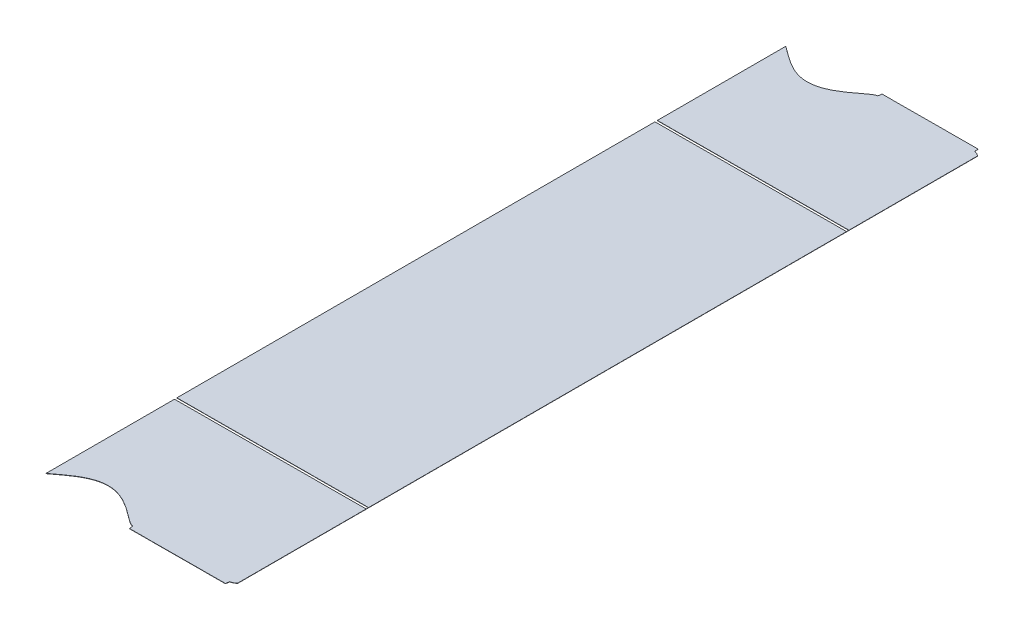
ISO-10303-21;
HEADER;
FILE_DESCRIPTION(('STEP AP214'),'2;1');
FILE_NAME('part.step','',(''),(''),'','','');
FILE_SCHEMA(('AUTOMOTIVE_DESIGN { 1 0 10303 214 1 1 1 1 }'));
ENDSEC;
DATA;
#1=APPLICATION_CONTEXT('core data for automotive mechanical design processes');
#2=APPLICATION_PROTOCOL_DEFINITION('international standard','automotive_design',2000,#1);
#3=PRODUCT_CONTEXT('',#1,'mechanical');
#4=PRODUCT('Part','Part','',(#3));
#5=PRODUCT_RELATED_PRODUCT_CATEGORY('part','',(#4));
#6=PRODUCT_DEFINITION_FORMATION('','',#4);
#7=PRODUCT_DEFINITION_CONTEXT('part definition',#1,'design');
#8=PRODUCT_DEFINITION('design','',#6,#7);
#9=PRODUCT_DEFINITION_SHAPE('','',#8);
#10=(LENGTH_UNIT() NAMED_UNIT(*) SI_UNIT(.MILLI.,.METRE.));
#11=(NAMED_UNIT(*) PLANE_ANGLE_UNIT() SI_UNIT($,.RADIAN.));
#12=(NAMED_UNIT(*) SI_UNIT($,.STERADIAN.) SOLID_ANGLE_UNIT());
#13=UNCERTAINTY_MEASURE_WITH_UNIT(LENGTH_MEASURE(1.E-05),#10,'distance_accuracy_value','');
#14=(GEOMETRIC_REPRESENTATION_CONTEXT(3) GLOBAL_UNCERTAINTY_ASSIGNED_CONTEXT((#13)) GLOBAL_UNIT_ASSIGNED_CONTEXT((#10,
#11,#12)) REPRESENTATION_CONTEXT('',''));
#15=CARTESIAN_POINT('',(0.,0.,0.));
#16=DIRECTION('',(0.,0.,1.));
#17=DIRECTION('',(1.,0.,0.));
#18=AXIS2_PLACEMENT_3D('',#15,#16,#17);
#19=CARTESIAN_POINT('',(-479.431668854931,493.816892477941,-153.223013684118));
#20=DIRECTION('',(0.999992126449225,0.00396825396825353,0.));
#21=DIRECTION('',(-0.00396825396825353,0.999992126449225,0.));
#22=AXIS2_PLACEMENT_3D('',#19,#20,#21);
#23=PLANE('',#22);
#24=DIRECTION('',(-0.00396825396825353,0.999992126449225,0.));
#25=VECTOR('',#24,1.);
#26=CARTESIAN_POINT('',(-479.431668854931,493.816892477941,100.));
#27=LINE('',#26,#25);
#28=CARTESIAN_POINT('',(-479.431272029534,493.716893265296,100.));
#29=VERTEX_POINT('',#28);
#30=CARTESIAN_POINT('',(-479.431668854931,493.816892477941,100.));
#31=VERTEX_POINT('',#30);
#32=EDGE_CURVE('E220',#29,#31,#27,.T.);
#33=ORIENTED_EDGE('',*,*,#32,.F.);
#34=DIRECTION('',(0.,0.,1.));
#35=VECTOR('',#34,1.);
#36=CARTESIAN_POINT('',(-479.431272029534,493.716893265296,-153.223013684118));
#37=LINE('',#36,#35);
#38=CARTESIAN_POINT('',(-479.431272029534,493.716893265296,153.223013684118));
#39=VERTEX_POINT('',#38);
#40=EDGE_CURVE('E269',#29,#39,#37,.T.);
#41=ORIENTED_EDGE('',*,*,#40,.T.);
#42=DIRECTION('',(0.00396825396825353,-0.999992126449225,0.));
#43=VECTOR('',#42,1.);
#44=CARTESIAN_POINT('',(-479.431668854931,493.816892477941,153.223013684118));
#45=LINE('',#44,#43);
#46=CARTESIAN_POINT('',(-479.431668854931,493.816892477941,153.223013684118));
#47=VERTEX_POINT('',#46);
#48=EDGE_CURVE('E327',#47,#39,#45,.T.);
#49=ORIENTED_EDGE('',*,*,#48,.F.);
#50=DIRECTION('',(0.,0.,1.));
#51=VECTOR('',#50,1.);
#52=CARTESIAN_POINT('',(-479.431668854931,493.816892477941,-153.223013684118));
#53=LINE('',#52,#51);
#54=EDGE_CURVE('E389',#31,#47,#53,.T.);
#55=ORIENTED_EDGE('',*,*,#54,.F.);
#56=EDGE_LOOP('',(#33,#41,#49,#55));
#57=FACE_BOUND('',#56,.T.);
#58=ADVANCED_FACE('F60',(#57),#23,.F.);
#59=DIRECTION('',(0.00396825396825353,-0.999992126449225,0.));
#60=VECTOR('',#59,1.);
#61=CARTESIAN_POINT('',(-479.431668854931,493.816892477941,98.9999999999999));
#62=LINE('',#61,#60);
#63=CARTESIAN_POINT('',(-479.431668854931,493.816892477941,98.9999999999999));
#64=VERTEX_POINT('',#63);
#65=CARTESIAN_POINT('',(-479.431272029534,493.716893265296,98.9999999999998));
#66=VERTEX_POINT('',#65);
#67=EDGE_CURVE('E221',#64,#66,#62,.T.);
#68=ORIENTED_EDGE('',*,*,#67,.F.);
#69=CARTESIAN_POINT('',(-479.431668854931,493.816892477941,-99.0000000000001));
#70=VERTEX_POINT('',#69);
#71=EDGE_CURVE('E219',#70,#64,#53,.T.);
#72=ORIENTED_EDGE('',*,*,#71,.F.);
#73=DIRECTION('',(-0.00396825396825353,0.999992126449225,0.));
#74=VECTOR('',#73,1.);
#75=CARTESIAN_POINT('',(-479.431668854931,493.816892477941,-99.));
#76=LINE('',#75,#74);
#77=CARTESIAN_POINT('',(-479.431272029534,493.716893265296,-99.0000000000002));
#78=VERTEX_POINT('',#77);
#79=EDGE_CURVE('E353',#78,#70,#76,.T.);
#80=ORIENTED_EDGE('',*,*,#79,.F.);
#81=EDGE_CURVE('E277',#78,#66,#37,.T.);
#82=ORIENTED_EDGE('',*,*,#81,.T.);
#83=EDGE_LOOP('',(#68,#72,#80,#82));
#84=FACE_BOUND('',#83,.T.);
#85=ADVANCED_FACE('F361',(#84),#23,.F.);
#86=CARTESIAN_POINT('',(2716.99564082049,506.501227704552,3272.92410906233));
#87=DIRECTION('',(-0.00396825396825352,0.999992126449225,0.));
#88=DIRECTION('',(-0.999992126449225,-0.00396825396825352,0.));
#89=AXIS2_PLACEMENT_3D('',#86,#87,#88);
#90=PLANE('',#89);
#91=DIRECTION('',(0.,0.,1.));
#92=VECTOR('',#91,1.);
#93=CARTESIAN_POINT('',(-400.050396825397,494.131900005905,-153.292164397325));
#94=LINE('',#93,#92);
#95=CARTESIAN_POINT('',(-400.050396825397,494.131900005905,99.9999999999999));
#96=VERTEX_POINT('',#95);
#97=CARTESIAN_POINT('',(-400.050396825397,494.131900005905,153.292164397326));
#98=VERTEX_POINT('',#97);
#99=EDGE_CURVE('E228',#96,#98,#94,.T.);
#100=ORIENTED_EDGE('',*,*,#99,.F.);
#101=DIRECTION('',(-0.999992126449225,-0.00396825396825352,0.));
#102=VECTOR('',#101,1.);
#103=CARTESIAN_POINT('',(2716.99564082049,506.501227704552,100.));
#104=LINE('',#103,#102);
#105=EDGE_CURVE('E461',#96,#31,#104,.T.);
#106=ORIENTED_EDGE('',*,*,#105,.T.);
#107=ORIENTED_EDGE('',*,*,#54,.T.);
#108=CARTESIAN_POINT('',(-442.431061801277,493.963721439775,154.262931630912));
#109=CARTESIAN_POINT('',(-442.591631623107,493.963084252925,154.262974500133));
#110=CARTESIAN_POINT('',(-442.912981243013,493.96180904598,154.202254506324));
#111=CARTESIAN_POINT('',(-443.351084597071,493.960070526919,154.053043762409));
#112=CARTESIAN_POINT('',(-443.934449320149,493.957755569315,153.739597349899));
#113=CARTESIAN_POINT('',(-444.489085882647,493.955554613245,153.383793422581));
#114=CARTESIAN_POINT('',(-444.786625588,493.954373890832,153.175910568641));
#115=CARTESIAN_POINT('',(-445.208979985696,493.952697868121,152.880823103045));
#116=CARTESIAN_POINT('',(-445.846071955568,493.950169705478,152.404899446286));
#117=CARTESIAN_POINT('',(-446.061276671207,493.949315711787,152.244136134138));
#118=CARTESIAN_POINT('',(-446.625932400914,493.947074996805,151.8182250494));
#119=CARTESIAN_POINT('',(-447.46885109117,493.943730055031,151.180945823583));
#120=CARTESIAN_POINT('',(-447.922424993525,493.941930144421,150.843545013171));
#121=CARTESIAN_POINT('',(-448.483580695191,493.939703318548,150.426117141931));
#122=CARTESIAN_POINT('',(-448.970134964303,493.937772532437,150.075627268659));
#123=CARTESIAN_POINT('',(-450.121645096203,493.933203011808,149.246135748754));
#124=CARTESIAN_POINT('',(-451.129980630493,493.929201648818,148.594589446881));
#125=CARTESIAN_POINT('',(-452.289992781982,493.924598389751,147.845035749992));
#126=CARTESIAN_POINT('',(-453.367727223459,493.920321632103,147.259873451391));
#127=CARTESIAN_POINT('',(-454.578789572927,493.91551579129,146.602319975423));
#128=CARTESIAN_POINT('',(-455.732811540838,493.91093630298,146.126381248756));
#129=CARTESIAN_POINT('',(-456.992552417681,493.905937291886,145.606842205717));
#130=CARTESIAN_POINT('',(-459.507782600744,493.895956141144,144.956863987269));
#131=CARTESIAN_POINT('',(-462.093411956329,493.885695626407,144.729647743447));
#132=CARTESIAN_POINT('',(-464.68729863891,493.875402344241,144.963887418469));
#133=CARTESIAN_POINT('',(-467.212399896033,493.865382022261,145.625036313167));
#134=CARTESIAN_POINT('',(-468.473936649228,493.860375884618,146.149467436179));
#135=CARTESIAN_POINT('',(-469.622449980007,493.855818256151,146.62691380017));
#136=CARTESIAN_POINT('',(-470.828214311532,493.851033439384,147.284375163813));
#137=CARTESIAN_POINT('',(-471.910430832478,493.846738895567,147.8744702023));
#138=CARTESIAN_POINT('',(-473.076869107019,493.842110135811,148.630865638333));
#139=CARTESIAN_POINT('',(-474.077490900206,493.838139383145,149.279734741894));
#140=CARTESIAN_POINT('',(-475.222134181215,493.833597112139,150.105598241184));
#141=CARTESIAN_POINT('',(-475.708137335926,493.831668513007,150.456250949039));
#142=CARTESIAN_POINT('',(-476.271534551234,493.829432792169,150.875783704997));
#143=CARTESIAN_POINT('',(-476.671169570571,493.827846926431,151.173371226703));
#144=CARTESIAN_POINT('',(-477.318873737737,493.825276651562,151.662594456796));
#145=CARTESIAN_POINT('',(-477.748556584883,493.823571547474,151.987142052832));
#146=CARTESIAN_POINT('',(-477.843166287971,493.823196109188,152.058462379137));
#147=CARTESIAN_POINT('',(-478.148022723046,493.821986351905,152.288274541273));
#148=CARTESIAN_POINT('',(-478.368072586016,493.821113131287,152.452339942692));
#149=CARTESIAN_POINT('',(-479.005890197137,493.818582089093,152.927885807564));
#150=CARTESIAN_POINT('',(-479.431668854931,493.816892477941,153.223013684118));
#151=B_SPLINE_CURVE_WITH_KNOTS('',2,(#108,#109,#110,#111,#112,#113,#114,#115,#116,#117,#118,
#119,#120,#121,#122,#123,#124,#125,#126,#127,#128,#129,#130,#131,#132,#133,#134,#135,#136,#137,
#138,#139,#140,#141,#142,#143,#144,#145,#146,#147,#148,#149,#150),.UNSPECIFIED.,.F.,.F.,(3,1,1,
1,1,2,2,1,1,2,2,2,2,2,1,1,1,1,2,2,2,2,2,2,2,2,3),(0.,0.0078125,0.015625,0.03125,0.046875,0.0625,
0.09375,0.109375,0.125,0.15625,0.1875,0.25,0.3125,0.375,0.4375,0.5,0.5625,0.625,0.6875,0.75,
0.8125,0.875,0.90625,0.9375,0.953125,0.96875,1.),.UNSPECIFIED.);
#152=CARTESIAN_POINT('',(-442.431062306304,493.963721437771,154.262931631046));
#153=VERTEX_POINT('',#152);
#154=EDGE_CURVE('E376',#153,#47,#151,.T.);
#155=ORIENTED_EDGE('',*,*,#154,.F.);
#156=CARTESIAN_POINT('',(-442.204431100698,493.964620775033,155.853529002968));
#157=CARTESIAN_POINT('',(-442.431061799364,493.963721439782,154.262931630641));
#158=B_SPLINE_CURVE_WITH_KNOTS('',1,(#156,#157),.UNSPECIFIED.,.F.,.F.,(2,2),(0.,1.),.UNSPECIFIED.);
#159=CARTESIAN_POINT('',(-442.204431100698,493.964620775033,155.853529002968));
#160=VERTEX_POINT('',#159);
#161=EDGE_CURVE('E384',#160,#153,#158,.T.);
#162=ORIENTED_EDGE('',*,*,#161,.F.);
#163=DIRECTION('',(0.999992126449225,0.00396825396825379,0.));
#164=VECTOR('',#163,1.);
#165=CARTESIAN_POINT('',(-442.204431100698,493.964620775033,155.853529002968));
#166=LINE('',#165,#164);
#167=CARTESIAN_POINT('',(-402.463596936727,494.122323739588,155.853529002968));
#168=VERTEX_POINT('',#167);
#169=EDGE_CURVE('E392',#160,#168,#166,.T.);
#170=ORIENTED_EDGE('',*,*,#169,.T.);
#171=CARTESIAN_POINT('',(-402.236966236885,494.123223074843,154.262931622385));
#172=CARTESIAN_POINT('',(-402.463596936727,494.122323739588,155.853529002968));
#173=B_SPLINE_CURVE_WITH_KNOTS('',1,(#171,#172),.UNSPECIFIED.,.F.,.F.,(2,2),(0.,1.),.UNSPECIFIED.);
#174=CARTESIAN_POINT('',(-402.236966308139,494.12322307456,154.262932122479));
#175=VERTEX_POINT('',#174);
#176=EDGE_CURVE('E523',#175,#168,#173,.T.);
#177=ORIENTED_EDGE('',*,*,#176,.F.);
#178=CARTESIAN_POINT('',(-400.050396825397,494.131900005905,153.292164397326));
#179=CARTESIAN_POINT('',(-400.325449037619,494.130808520279,153.480369020719));
#180=CARTESIAN_POINT('',(-400.842365712859,494.12875724748,153.802046870863));
#181=CARTESIAN_POINT('',(-401.383685975265,494.126609134287,154.080098229055));
#182=CARTESIAN_POINT('',(-401.954403984286,494.124344362451,154.262693150855));
#183=CARTESIAN_POINT('',(-402.236966236875,494.123223074843,154.262931622453));
#184=B_SPLINE_CURVE_WITH_KNOTS('',2,(#178,#179,#180,#181,#182,#183),.UNSPECIFIED.,.F.,.F.,(3,1,
1,1,3),(0.,0.25,0.5,0.75,1.),.UNSPECIFIED.);
#185=EDGE_CURVE('E231',#98,#175,#184,.T.);
#186=ORIENTED_EDGE('',*,*,#185,.F.);
#187=EDGE_LOOP('',(#100,#106,#107,#155,#162,#170,#177,#186));
#188=FACE_BOUND('',#187,.T.);
#189=ADVANCED_FACE('F387',(#188),#90,.T.);
#190=ORIENTED_EDGE('',*,*,#71,.T.);
#191=DIRECTION('',(0.999992126449225,0.00396825396825352,0.));
#192=VECTOR('',#191,1.);
#193=CARTESIAN_POINT('',(2716.99564082049,506.501227704552,98.9999999999998));
#194=LINE('',#193,#192);
#195=CARTESIAN_POINT('',(-400.050396825397,494.131900005905,99.));
#196=VERTEX_POINT('',#195);
#197=EDGE_CURVE('E207',#64,#196,#194,.T.);
#198=ORIENTED_EDGE('',*,*,#197,.T.);
#199=CARTESIAN_POINT('',(-400.050396825397,494.131900005905,-99.));
#200=VERTEX_POINT('',#199);
#201=EDGE_CURVE('E216',#200,#196,#94,.T.);
#202=ORIENTED_EDGE('',*,*,#201,.F.);
#203=DIRECTION('',(-0.999992126449225,-0.00396825396825352,0.));
#204=VECTOR('',#203,1.);
#205=CARTESIAN_POINT('',(2716.99564082049,506.501227704552,-99.0000000000002));
#206=LINE('',#205,#204);
#207=EDGE_CURVE('E244',#200,#70,#206,.T.);
#208=ORIENTED_EDGE('',*,*,#207,.T.);
#209=EDGE_LOOP('',(#190,#198,#202,#208));
#210=FACE_BOUND('',#209,.T.);
#211=ADVANCED_FACE('F214',(#210),#90,.T.);
#212=CARTESIAN_POINT('',(2716.99603764588,506.401228491907,3272.92410906233));
#213=DIRECTION('',(-0.00396825396825352,0.999992126449225,0.));
#214=DIRECTION('',(-0.999992126449225,-0.00396825396825352,0.));
#215=AXIS2_PLACEMENT_3D('',#212,#213,#214);
#216=PLANE('',#215);
#217=DIRECTION('',(-0.999992126449225,-0.00396825396825352,0.));
#218=VECTOR('',#217,1.);
#219=CARTESIAN_POINT('',(2716.99603764588,506.401228491907,100.));
#220=LINE('',#219,#218);
#221=CARTESIAN_POINT('',(-400.050396825397,494.031899218544,100.));
#222=VERTEX_POINT('',#221);
#223=EDGE_CURVE('E13',#222,#29,#220,.T.);
#224=ORIENTED_EDGE('',*,*,#223,.F.);
#225=DIRECTION('',(0.,0.,1.));
#226=VECTOR('',#225,1.);
#227=CARTESIAN_POINT('',(-400.050396825397,494.031899218544,3272.92410906233));
#228=LINE('',#227,#226);
#229=CARTESIAN_POINT('',(-400.050396825397,494.031899218544,98.9999999999999));
#230=VERTEX_POINT('',#229);
#231=EDGE_CURVE('E465',#230,#222,#228,.T.);
#232=ORIENTED_EDGE('',*,*,#231,.F.);
#233=DIRECTION('',(0.999992126449225,0.00396825396825352,0.));
#234=VECTOR('',#233,1.);
#235=CARTESIAN_POINT('',(2716.99603764588,506.401228491907,98.9999999999998));
#236=LINE('',#235,#234);
#237=EDGE_CURVE('E69',#66,#230,#236,.T.);
#238=ORIENTED_EDGE('',*,*,#237,.F.);
#239=ORIENTED_EDGE('',*,*,#81,.F.);
#240=DIRECTION('',(-0.999992126449225,-0.00396825396825352,0.));
#241=VECTOR('',#240,1.);
#242=CARTESIAN_POINT('',(2716.99603764588,506.401228491907,-99.0000000000002));
#243=LINE('',#242,#241);
#244=CARTESIAN_POINT('',(-400.050396825397,494.031899218544,-99.));
#245=VERTEX_POINT('',#244);
#246=EDGE_CURVE('E347',#245,#78,#243,.T.);
#247=ORIENTED_EDGE('',*,*,#246,.F.);
#248=DIRECTION('',(0.,0.,1.));
#249=VECTOR('',#248,1.);
#250=CARTESIAN_POINT('',(-400.050396825397,494.031899218544,3272.92410906233));
#251=LINE('',#250,#249);
#252=CARTESIAN_POINT('',(-400.050396825397,494.031899218544,-100.));
#253=VERTEX_POINT('',#252);
#254=EDGE_CURVE('E345',#253,#245,#251,.T.);
#255=ORIENTED_EDGE('',*,*,#254,.F.);
#256=DIRECTION('',(0.999992126449225,0.00396825396825352,0.));
#257=VECTOR('',#256,1.);
#258=CARTESIAN_POINT('',(2716.99603764588,506.401228491907,-100.));
#259=LINE('',#258,#257);
#260=CARTESIAN_POINT('',(-479.431272029534,493.716893265296,-100.));
#261=VERTEX_POINT('',#260);
#262=EDGE_CURVE('E343',#261,#253,#259,.T.);
#263=ORIENTED_EDGE('',*,*,#262,.F.);
#264=CARTESIAN_POINT('',(-479.431272029534,493.716893265296,-153.223013684118));
#265=VERTEX_POINT('',#264);
#266=EDGE_CURVE('E270',#265,#261,#37,.T.);
#267=ORIENTED_EDGE('',*,*,#266,.F.);
#268=CARTESIAN_POINT('',(-442.43066497588,493.86372222713,-154.262931630912));
#269=CARTESIAN_POINT('',(-442.591204792267,493.863085159351,-154.262984574164));
#270=CARTESIAN_POINT('',(-442.912632818508,493.861809641267,-154.202241361555));
#271=CARTESIAN_POINT('',(-443.350733763391,493.860071131766,-154.053022569922));
#272=CARTESIAN_POINT('',(-443.934095838442,493.85775618467,-153.739571331279));
#273=CARTESIAN_POINT('',(-444.488730894892,493.855555234577,-153.383765152017));
#274=CARTESIAN_POINT('',(-444.786228762603,493.854374678187,-153.175910568641));
#275=CARTESIAN_POINT('',(-445.208622716034,493.852698498508,-152.880794103147));
#276=CARTESIAN_POINT('',(-445.845675130171,493.850170492833,-152.404899446286));
#277=CARTESIAN_POINT('',(-446.094436222427,493.849183337869,-152.219068465957));
#278=CARTESIAN_POINT('',(-446.625535547486,493.847075784271,-151.817993059465));
#279=CARTESIAN_POINT('',(-447.514834130099,493.843546793856,-151.146444867143));
#280=CARTESIAN_POINT('',(-447.922028168128,493.841930931776,-150.843545013171));
#281=CARTESIAN_POINT('',(-448.483223220225,493.83970394975,-150.426088264166));
#282=CARTESIAN_POINT('',(-448.969738138906,493.837773319792,-150.075627268659));
#283=CARTESIAN_POINT('',(-450.121288465414,493.83320363966,-149.24610805289));
#284=CARTESIAN_POINT('',(-451.129583805096,493.829202436173,-148.594589446881));
#285=CARTESIAN_POINT('',(-452.28963850106,493.824599008277,-147.845010242589));
#286=CARTESIAN_POINT('',(-453.367330398062,493.820322419458,-147.259873451391));
#287=CARTESIAN_POINT('',(-454.578437514195,493.815516400998,-146.602298374783));
#288=CARTESIAN_POINT('',(-455.732414715441,493.810937090335,-146.126381248756));
#289=CARTESIAN_POINT('',(-456.992202863831,493.805937891654,-145.606826135936));
#290=CARTESIAN_POINT('',(-459.507434779736,493.795956734036,-144.956855403501));
#291=CARTESIAN_POINT('',(-462.093064586266,493.785696217509,-144.72964780064));
#292=CARTESIAN_POINT('',(-464.686950730265,493.77540293748,-144.963896145715));
#293=CARTESIAN_POINT('',(-467.21205042763,493.76538262169,-145.625052545308));
#294=CARTESIAN_POINT('',(-468.473539823831,493.760376671973,-146.149467436179));
#295=CARTESIAN_POINT('',(-469.622098100956,493.755818865146,-146.626935630022));
#296=CARTESIAN_POINT('',(-470.827817486136,493.751034226739,-147.284375163813));
#297=CARTESIAN_POINT('',(-471.910076489949,493.746739514338,-147.874495770361));
#298=CARTESIAN_POINT('',(-473.076472281622,493.742110923166,-148.630865638333));
#299=CARTESIAN_POINT('',(-474.077134166928,493.738140011403,-149.279762439468));
#300=CARTESIAN_POINT('',(-475.221737355819,493.733597899494,-150.105598241184));
#301=CARTESIAN_POINT('',(-475.707779754487,493.731669144631,-150.456279785555));
#302=CARTESIAN_POINT('',(-476.271137725837,493.729433579524,-150.875783704997));
#303=CARTESIAN_POINT('',(-476.670803846873,493.727847590366,-151.173394660675));
#304=CARTESIAN_POINT('',(-477.318476912341,493.725277438917,-151.662594456796));
#305=CARTESIAN_POINT('',(-477.748156756163,493.723572346747,-151.987139822664));
#306=CARTESIAN_POINT('',(-477.842769462574,493.723196896543,-152.058462379137));
#307=CARTESIAN_POINT('',(-478.147664622981,493.721986985587,-152.288303624793));
#308=CARTESIAN_POINT('',(-478.367675760619,493.721113918642,-152.452339942692));
#309=CARTESIAN_POINT('',(-479.005561307514,493.718582606859,-152.927935848779));
#310=CARTESIAN_POINT('',(-479.431272029534,493.716893265296,-153.223013684118));
#311=B_SPLINE_CURVE_WITH_KNOTS('',2,(#268,#269,#270,#271,#272,#273,#274,#275,#276,#277,#278,
#279,#280,#281,#282,#283,#284,#285,#286,#287,#288,#289,#290,#291,#292,#293,#294,#295,#296,#297,
#298,#299,#300,#301,#302,#303,#304,#305,#306,#307,#308,#309,#310),.UNSPECIFIED.,.F.,.F.,(3,1,1,
1,1,2,2,1,1,2,2,2,2,2,1,1,1,1,2,2,2,2,2,2,2,2,3),(0.,0.0078125,0.015625,0.03125,0.046875,0.0625,
0.09375,0.109375,0.125,0.15625,0.1875,0.25,0.3125,0.375,0.4375,0.5,0.5625,0.625,0.6875,0.75,
0.8125,0.875,0.90625,0.9375,0.953125,0.96875,1.),.UNSPECIFIED.);
#312=CARTESIAN_POINT('',(-442.43066490271,493.86372222742,-154.262932130752));
#313=VERTEX_POINT('',#312);
#314=EDGE_CURVE('E262',#313,#265,#311,.T.);
#315=ORIENTED_EDGE('',*,*,#314,.F.);
#316=CARTESIAN_POINT('',(-442.204034275302,493.864621562388,-155.853529002968));
#317=CARTESIAN_POINT('',(-442.430664973967,493.863722227138,-154.262931630639));
#318=B_SPLINE_CURVE_WITH_KNOTS('',1,(#316,#317),.UNSPECIFIED.,.F.,.F.,(2,2),(0.,1.),.UNSPECIFIED.);
#319=CARTESIAN_POINT('',(-442.204034275302,493.864621562388,-155.853529002968));
#320=VERTEX_POINT('',#319);
#321=EDGE_CURVE('E258',#320,#313,#318,.T.);
#322=ORIENTED_EDGE('',*,*,#321,.F.);
#323=DIRECTION('',(0.999992126449225,0.00396825396825379,0.));
#324=VECTOR('',#323,1.);
#325=CARTESIAN_POINT('',(-442.204034275302,493.864621562388,-155.853529002968));
#326=LINE('',#325,#324);
#327=CARTESIAN_POINT('',(-402.46320011133,494.022324526943,-155.853529002968));
#328=VERTEX_POINT('',#327);
#329=EDGE_CURVE('E252',#320,#328,#326,.T.);
#330=ORIENTED_EDGE('',*,*,#329,.T.);
#331=CARTESIAN_POINT('',(-402.236569411479,494.023223862198,-154.26293162232));
#332=CARTESIAN_POINT('',(-402.46320011133,494.022324526943,-155.853529002968));
#333=B_SPLINE_CURVE_WITH_KNOTS('',1,(#331,#332),.UNSPECIFIED.,.F.,.F.,(2,2),(0.,1.),.UNSPECIFIED.);
#334=CARTESIAN_POINT('',(-402.236568906376,494.023223864202,-154.262931622058));
#335=VERTEX_POINT('',#334);
#336=EDGE_CURVE('E243',#335,#328,#333,.T.);
#337=ORIENTED_EDGE('',*,*,#336,.F.);
#338=CARTESIAN_POINT('',(-400.05,494.03190079326,-153.292164397326));
#339=CARTESIAN_POINT('',(-400.325042875258,494.030809344685,-153.48036475814));
#340=CARTESIAN_POINT('',(-400.842012661141,494.028757861129,-153.802072200254));
#341=CARTESIAN_POINT('',(-401.383335177657,494.026609738991,-154.080118291457));
#342=CARTESIAN_POINT('',(-401.954082753664,494.024344849825,-154.262710741293));
#343=CARTESIAN_POINT('',(-402.236569411478,494.023223862198,-154.262931622453));
#344=B_SPLINE_CURVE_WITH_KNOTS('',2,(#338,#339,#340,#341,#342,#343),.UNSPECIFIED.,.F.,.F.,(3,1,
1,1,3),(0.,0.25,0.5,0.75,1.),.UNSPECIFIED.);
#345=CARTESIAN_POINT('',(-400.05,494.03190079326,-153.292164397326));
#346=VERTEX_POINT('',#345);
#347=EDGE_CURVE('E238',#346,#335,#344,.T.);
#348=ORIENTED_EDGE('',*,*,#347,.F.);
#349=DIRECTION('',(0.,0.,1.));
#350=VECTOR('',#349,1.);
#351=CARTESIAN_POINT('',(-400.05,494.03190079326,-153.292164397325));
#352=LINE('',#351,#350);
#353=CARTESIAN_POINT('',(-400.05,494.03190079326,153.292164397326));
#354=VERTEX_POINT('',#353);
#355=EDGE_CURVE('E309',#346,#354,#352,.T.);
#356=ORIENTED_EDGE('',*,*,#355,.T.);
#357=CARTESIAN_POINT('',(-400.05,494.03190079326,153.292164397326));
#358=CARTESIAN_POINT('',(-400.325052212222,494.030809307634,153.480369020719));
#359=CARTESIAN_POINT('',(-400.841968887462,494.028758034835,153.802046870863));
#360=CARTESIAN_POINT('',(-401.383289149868,494.026609921642,154.080098229055));
#361=CARTESIAN_POINT('',(-401.954007158889,494.024345149807,154.262693150855));
#362=CARTESIAN_POINT('',(-402.236569411478,494.023223862198,154.262931622453));
#363=B_SPLINE_CURVE_WITH_KNOTS('',2,(#357,#358,#359,#360,#361,#362),.UNSPECIFIED.,.F.,.F.,(3,1,
1,1,3),(0.,0.25,0.5,0.75,1.),.UNSPECIFIED.);
#364=CARTESIAN_POINT('',(-402.236569482742,494.023223861915,154.262932122479));
#365=VERTEX_POINT('',#364);
#366=EDGE_CURVE('E301',#354,#365,#363,.T.);
#367=ORIENTED_EDGE('',*,*,#366,.T.);
#368=CARTESIAN_POINT('',(-402.236569411488,494.023223862198,154.262931622385));
#369=CARTESIAN_POINT('',(-402.46320011133,494.022324526943,155.853529002968));
#370=B_SPLINE_CURVE_WITH_KNOTS('',1,(#368,#369),.UNSPECIFIED.,.F.,.F.,(2,2),(0.,1.),.UNSPECIFIED.);
#371=CARTESIAN_POINT('',(-402.46320011133,494.022324526943,155.853529002968));
#372=VERTEX_POINT('',#371);
#373=EDGE_CURVE('E296',#365,#372,#370,.T.);
#374=ORIENTED_EDGE('',*,*,#373,.T.);
#375=DIRECTION('',(0.999992126449225,0.00396825396825379,0.));
#376=VECTOR('',#375,1.);
#377=CARTESIAN_POINT('',(-442.204034275302,493.864621562388,155.853529002968));
#378=LINE('',#377,#376);
#379=CARTESIAN_POINT('',(-442.204034275302,493.864621562388,155.853529002968));
#380=VERTEX_POINT('',#379);
#381=EDGE_CURVE('E290',#380,#372,#378,.T.);
#382=ORIENTED_EDGE('',*,*,#381,.F.);
#383=CARTESIAN_POINT('',(-442.204034275302,493.864621562388,155.853529002968));
#384=CARTESIAN_POINT('',(-442.430664973967,493.863722227138,154.262931630641));
#385=B_SPLINE_CURVE_WITH_KNOTS('',1,(#383,#384),.UNSPECIFIED.,.F.,.F.,(2,2),(0.,1.),.UNSPECIFIED.);
#386=CARTESIAN_POINT('',(-442.430665480907,493.863722225126,154.262931631046));
#387=VERTEX_POINT('',#386);
#388=EDGE_CURVE('E282',#380,#387,#385,.T.);
#389=ORIENTED_EDGE('',*,*,#388,.T.);
#390=CARTESIAN_POINT('',(-442.43066497588,493.86372222713,154.262931630912));
#391=CARTESIAN_POINT('',(-442.59123479771,493.86308504028,154.262974500133));
#392=CARTESIAN_POINT('',(-442.912584417616,493.861809833336,154.202254506324));
#393=CARTESIAN_POINT('',(-443.350687771674,493.860071314274,154.053043762409));
#394=CARTESIAN_POINT('',(-443.934052494752,493.85775635667,153.739597349899));
#395=CARTESIAN_POINT('',(-444.48868905725,493.8555554006,153.383793422581));
#396=CARTESIAN_POINT('',(-444.786228762603,493.854374678187,153.175910568641));
#397=CARTESIAN_POINT('',(-445.208583160299,493.852698655477,152.880823103045));
#398=CARTESIAN_POINT('',(-445.845675130171,493.850170492833,152.404899446286));
#399=CARTESIAN_POINT('',(-446.06087984581,493.849316499143,152.244136134138));
#400=CARTESIAN_POINT('',(-446.625535575517,493.84707578416,151.8182250494));
#401=CARTESIAN_POINT('',(-447.468454265774,493.843730842386,151.180945823583));
#402=CARTESIAN_POINT('',(-447.922028168128,493.841930931776,150.843545013171));
#403=CARTESIAN_POINT('',(-448.483183869794,493.839704105903,150.426117141931));
#404=CARTESIAN_POINT('',(-448.969738138906,493.837773319792,150.075627268659));
#405=CARTESIAN_POINT('',(-450.121248270806,493.833203799163,149.246135748754));
#406=CARTESIAN_POINT('',(-451.129583805096,493.829202436173,148.594589446881));
#407=CARTESIAN_POINT('',(-452.289595956585,493.824599177106,147.845035749992));
#408=CARTESIAN_POINT('',(-453.367330398062,493.820322419458,147.259873451391));
#409=CARTESIAN_POINT('',(-454.57839274753,493.815516578645,146.602319975423));
#410=CARTESIAN_POINT('',(-455.732414715441,493.810937090335,146.126381248756));
#411=CARTESIAN_POINT('',(-456.992155592284,493.805938079241,145.606842205717));
#412=CARTESIAN_POINT('',(-459.507385775348,493.795956928499,144.956863987269));
#413=CARTESIAN_POINT('',(-462.093015130932,493.785696413762,144.729647743447));
#414=CARTESIAN_POINT('',(-464.686901813513,493.775403131596,144.963887418469));
#415=CARTESIAN_POINT('',(-467.212003070636,493.765382809616,145.625036313167));
#416=CARTESIAN_POINT('',(-468.473539823831,493.760376671973,146.149467436179));
#417=CARTESIAN_POINT('',(-469.62205315461,493.755819043506,146.62691380017));
#418=CARTESIAN_POINT('',(-470.827817486136,493.751034226739,147.284375163813));
#419=CARTESIAN_POINT('',(-471.910034007081,493.746739682922,147.8744702023));
#420=CARTESIAN_POINT('',(-473.076472281622,493.742110923166,148.630865638333));
#421=CARTESIAN_POINT('',(-474.077094074809,493.7381401705,149.279734741894));
#422=CARTESIAN_POINT('',(-475.221737355819,493.733597899494,150.105598241184));
#423=CARTESIAN_POINT('',(-475.707740510529,493.731669300362,150.456250949039));
#424=CARTESIAN_POINT('',(-476.271137725837,493.729433579524,150.875783704997));
#425=CARTESIAN_POINT('',(-476.670772745174,493.727847713786,151.173371226703));
#426=CARTESIAN_POINT('',(-477.318476912341,493.725277438917,151.662594456796));
#427=CARTESIAN_POINT('',(-477.748159759487,493.723572334829,151.987142052832));
#428=CARTESIAN_POINT('',(-477.842769462574,493.723196896543,152.058462379137));
#429=CARTESIAN_POINT('',(-478.147625897649,493.72198713926,152.288274541273));
#430=CARTESIAN_POINT('',(-478.367675760619,493.721113918642,152.452339942692));
#431=CARTESIAN_POINT('',(-479.00549337174,493.718582876448,152.927885807564));
#432=CARTESIAN_POINT('',(-479.431272029534,493.716893265296,153.223013684118));
#433=B_SPLINE_CURVE_WITH_KNOTS('',2,(#390,#391,#392,#393,#394,#395,#396,#397,#398,#399,#400,
#401,#402,#403,#404,#405,#406,#407,#408,#409,#410,#411,#412,#413,#414,#415,#416,#417,#418,#419,
#420,#421,#422,#423,#424,#425,#426,#427,#428,#429,#430,#431,#432),.UNSPECIFIED.,.F.,.F.,(3,1,1,
1,1,2,2,1,1,2,2,2,2,2,1,1,1,1,2,2,2,2,2,2,2,2,3),(0.,0.0078125,0.015625,0.03125,0.046875,0.0625,
0.09375,0.109375,0.125,0.15625,0.1875,0.25,0.3125,0.375,0.4375,0.5,0.5625,0.625,0.6875,0.75,
0.8125,0.875,0.90625,0.9375,0.953125,0.96875,1.),.UNSPECIFIED.);
#434=EDGE_CURVE('E276',#387,#39,#433,.T.);
#435=ORIENTED_EDGE('',*,*,#434,.T.);
#436=ORIENTED_EDGE('',*,*,#40,.F.);
#437=EDGE_LOOP('',(#224,#232,#238,#239,#247,#255,#263,#267,#315,#322,#330,#337,#348,#356,#367,
#374,#382,#389,#435,#436));
#438=FACE_BOUND('',#437,.T.);
#439=ADVANCED_FACE('F365',(#438),#216,.F.);
#440=DIRECTION('',(0.00396825396825353,-0.999992126449225,0.));
#441=VECTOR('',#440,1.);
#442=CARTESIAN_POINT('',(-479.431668854931,493.816892477941,-100.));
#443=LINE('',#442,#441);
#444=CARTESIAN_POINT('',(-479.431668854931,493.816892477941,-100.));
#445=VERTEX_POINT('',#444);
#446=EDGE_CURVE('E84',#445,#261,#443,.T.);
#447=ORIENTED_EDGE('',*,*,#446,.F.);
#448=CARTESIAN_POINT('',(-479.431668854931,493.816892477941,-153.223013684118));
#449=VERTEX_POINT('',#448);
#450=EDGE_CURVE('E390',#449,#445,#53,.T.);
#451=ORIENTED_EDGE('',*,*,#450,.F.);
#452=DIRECTION('',(0.00396825396825353,-0.999992126449225,0.));
#453=VECTOR('',#452,1.);
#454=CARTESIAN_POINT('',(-479.431668854931,493.816892477941,-153.223013684118));
#455=LINE('',#454,#453);
#456=EDGE_CURVE('E330',#449,#265,#455,.T.);
#457=ORIENTED_EDGE('',*,*,#456,.T.);
#458=ORIENTED_EDGE('',*,*,#266,.T.);
#459=EDGE_LOOP('',(#447,#451,#457,#458));
#460=FACE_BOUND('',#459,.T.);
#461=ADVANCED_FACE('F414',(#460),#23,.F.);
#462=ORIENTED_EDGE('',*,*,#450,.T.);
#463=DIRECTION('',(0.999992126449225,0.00396825396825352,0.));
#464=VECTOR('',#463,1.);
#465=CARTESIAN_POINT('',(2716.99564082049,506.501227704552,-100.));
#466=LINE('',#465,#464);
#467=CARTESIAN_POINT('',(-400.050396825397,494.131900005905,-100.));
#468=VERTEX_POINT('',#467);
#469=EDGE_CURVE('E362',#445,#468,#466,.T.);
#470=ORIENTED_EDGE('',*,*,#469,.T.);
#471=CARTESIAN_POINT('',(-400.050396825397,494.131900005905,-153.292164397326));
#472=VERTEX_POINT('',#471);
#473=EDGE_CURVE('E227',#472,#468,#94,.T.);
#474=ORIENTED_EDGE('',*,*,#473,.F.);
#475=CARTESIAN_POINT('',(-400.050396825397,494.131900005905,-153.292164397326));
#476=CARTESIAN_POINT('',(-400.325439700655,494.13080855733,-153.48036475814));
#477=CARTESIAN_POINT('',(-400.842409486537,494.128757073774,-153.802072200254));
#478=CARTESIAN_POINT('',(-401.383732003054,494.126608951636,-154.080118291457));
#479=CARTESIAN_POINT('',(-401.954479579061,494.12434406247,-154.262710741293));
#480=CARTESIAN_POINT('',(-402.236966236875,494.123223074843,-154.262931622453));
#481=B_SPLINE_CURVE_WITH_KNOTS('',2,(#475,#476,#477,#478,#479,#480),.UNSPECIFIED.,.F.,.F.,(3,1,
1,1,3),(0.,0.25,0.5,0.75,1.),.UNSPECIFIED.);
#482=CARTESIAN_POINT('',(-402.236965731773,494.123223076847,-154.262931622058));
#483=VERTEX_POINT('',#482);
#484=EDGE_CURVE('E315',#472,#483,#481,.T.);
#485=ORIENTED_EDGE('',*,*,#484,.T.);
#486=CARTESIAN_POINT('',(-402.236966236876,494.123223074843,-154.26293162232));
#487=CARTESIAN_POINT('',(-402.463596936727,494.122323739588,-155.853529002968));
#488=B_SPLINE_CURVE_WITH_KNOTS('',1,(#486,#487),.UNSPECIFIED.,.F.,.F.,(2,2),(0.,1.),.UNSPECIFIED.);
#489=CARTESIAN_POINT('',(-402.463596936727,494.122323739588,-155.853529002968));
#490=VERTEX_POINT('',#489);
#491=EDGE_CURVE('E438',#483,#490,#488,.T.);
#492=ORIENTED_EDGE('',*,*,#491,.T.);
#493=DIRECTION('',(0.999992126449225,0.00396825396825379,0.));
#494=VECTOR('',#493,1.);
#495=CARTESIAN_POINT('',(-442.204431100698,493.964620775033,-155.853529002968));
#496=LINE('',#495,#494);
#497=CARTESIAN_POINT('',(-442.204431100698,493.964620775033,-155.853529002968));
#498=VERTEX_POINT('',#497);
#499=EDGE_CURVE('E432',#498,#490,#496,.T.);
#500=ORIENTED_EDGE('',*,*,#499,.F.);
#501=CARTESIAN_POINT('',(-442.204431100698,493.964620775033,-155.853529002968));
#502=CARTESIAN_POINT('',(-442.431061799364,493.963721439782,-154.262931630639));
#503=B_SPLINE_CURVE_WITH_KNOTS('',1,(#501,#502),.UNSPECIFIED.,.F.,.F.,(2,2),(0.,1.),.UNSPECIFIED.);
#504=CARTESIAN_POINT('',(-442.431061728107,493.963721440065,-154.262932130752));
#505=VERTEX_POINT('',#504);
#506=EDGE_CURVE('E425',#498,#505,#503,.T.);
#507=ORIENTED_EDGE('',*,*,#506,.T.);
#508=CARTESIAN_POINT('',(-442.431061801277,493.963721439775,-154.262931630912));
#509=CARTESIAN_POINT('',(-442.591601617664,493.963084371995,-154.262984574164));
#510=CARTESIAN_POINT('',(-442.913029643905,493.961808853912,-154.202241361555));
#511=CARTESIAN_POINT('',(-443.351130588787,493.960070344411,-154.053022569922));
#512=CARTESIAN_POINT('',(-443.934492663839,493.957755397315,-153.739571331279));
#513=CARTESIAN_POINT('',(-444.489127720289,493.955554447222,-153.383765152017));
#514=CARTESIAN_POINT('',(-444.786625588,493.954373890832,-153.175910568641));
#515=CARTESIAN_POINT('',(-445.209019541431,493.952697711153,-152.880794103147));
#516=CARTESIAN_POINT('',(-445.846071955568,493.950169705478,-152.404899446286));
#517=CARTESIAN_POINT('',(-446.094833047823,493.949182550514,-152.219068465957));
#518=CARTESIAN_POINT('',(-446.625932372883,493.947074996916,-151.817993059465));
#519=CARTESIAN_POINT('',(-447.515230955496,493.943546006501,-151.146444867143));
#520=CARTESIAN_POINT('',(-447.922424993525,493.941930144421,-150.843545013171));
#521=CARTESIAN_POINT('',(-448.483620045622,493.939703162394,-150.426088264166));
#522=CARTESIAN_POINT('',(-448.970134964303,493.937772532437,-150.075627268659));
#523=CARTESIAN_POINT('',(-450.121685290811,493.933202852305,-149.24610805289));
#524=CARTESIAN_POINT('',(-451.129980630493,493.929201648818,-148.594589446881));
#525=CARTESIAN_POINT('',(-452.290035326457,493.924598220922,-147.845010242589));
#526=CARTESIAN_POINT('',(-453.367727223459,493.920321632103,-147.259873451391));
#527=CARTESIAN_POINT('',(-454.578834339592,493.915515613643,-146.602298374783));
#528=CARTESIAN_POINT('',(-455.732811540838,493.91093630298,-146.126381248756));
#529=CARTESIAN_POINT('',(-456.992599689228,493.905937104299,-145.606826135936));
#530=CARTESIAN_POINT('',(-459.507831605133,493.895955946681,-144.956855403501));
#531=CARTESIAN_POINT('',(-462.093461411662,493.885695430154,-144.72964780064));
#532=CARTESIAN_POINT('',(-464.687347555662,493.875402150125,-144.963896145715));
#533=CARTESIAN_POINT('',(-467.212447253027,493.865381834335,-145.625052545308));
#534=CARTESIAN_POINT('',(-468.473936649228,493.860375884618,-146.149467436179));
#535=CARTESIAN_POINT('',(-469.622494926353,493.855818077791,-146.626935630022));
#536=CARTESIAN_POINT('',(-470.828214311532,493.851033439384,-147.284375163813));
#537=CARTESIAN_POINT('',(-471.910473315346,493.846738726983,-147.874495770361));
#538=CARTESIAN_POINT('',(-473.076869107019,493.842110135811,-148.630865638333));
#539=CARTESIAN_POINT('',(-474.077530992325,493.838139224048,-149.279762439468));
#540=CARTESIAN_POINT('',(-475.222134181215,493.833597112139,-150.105598241184));
#541=CARTESIAN_POINT('',(-475.708176579884,493.831668357276,-150.456279785555));
#542=CARTESIAN_POINT('',(-476.271534551234,493.829432792169,-150.875783704997));
#543=CARTESIAN_POINT('',(-476.671200672269,493.827846803011,-151.173394660675));
#544=CARTESIAN_POINT('',(-477.318873737738,493.825276651562,-151.662594456796));
#545=CARTESIAN_POINT('',(-477.74855358156,493.823571559392,-151.987139822664));
#546=CARTESIAN_POINT('',(-477.843166287971,493.823196109188,-152.058462379137));
#547=CARTESIAN_POINT('',(-478.148061448378,493.821986198232,-152.288303624793));
#548=CARTESIAN_POINT('',(-478.368072586016,493.821113131287,-152.452339942692));
#549=CARTESIAN_POINT('',(-479.005958132911,493.818581819504,-152.927935848779));
#550=CARTESIAN_POINT('',(-479.431668854931,493.816892477941,-153.223013684118));
#551=B_SPLINE_CURVE_WITH_KNOTS('',2,(#508,#509,#510,#511,#512,#513,#514,#515,#516,#517,#518,
#519,#520,#521,#522,#523,#524,#525,#526,#527,#528,#529,#530,#531,#532,#533,#534,#535,#536,#537,
#538,#539,#540,#541,#542,#543,#544,#545,#546,#547,#548,#549,#550),.UNSPECIFIED.,.F.,.F.,(3,1,1,
1,1,2,2,1,1,2,2,2,2,2,1,1,1,1,2,2,2,2,2,2,2,2,3),(0.,0.0078125,0.015625,0.03125,0.046875,0.0625,
0.09375,0.109375,0.125,0.15625,0.1875,0.25,0.3125,0.375,0.4375,0.5,0.5625,0.625,0.6875,0.75,
0.8125,0.875,0.90625,0.9375,0.953125,0.96875,1.),.UNSPECIFIED.);
#552=EDGE_CURVE('E420',#505,#449,#551,.T.);
#553=ORIENTED_EDGE('',*,*,#552,.T.);
#554=EDGE_LOOP('',(#462,#470,#474,#485,#492,#500,#507,#553));
#555=FACE_BOUND('',#554,.T.);
#556=ADVANCED_FACE('F483',(#555),#90,.T.);
#557=DIRECTION('',(0.00396825396825353,-0.999992126449225,0.));
#558=VECTOR('',#557,1.);
#559=SURFACE_OF_LINEAR_EXTRUSION('',#481,#558);
#560=ORIENTED_EDGE('',*,*,#347,.T.);
#561=DIRECTION('',(0.00396825396825353,-0.999992126449225,0.));
#562=VECTOR('',#561,1.);
#563=CARTESIAN_POINT('',(-402.236965731773,494.123223076847,-154.262931622058));
#564=LINE('',#563,#562);
#565=EDGE_CURVE('E340',#483,#335,#564,.T.);
#566=ORIENTED_EDGE('',*,*,#565,.F.);
#567=ORIENTED_EDGE('',*,*,#484,.F.);
#568=DIRECTION('',(0.00396825396825353,-0.999992126449225,0.));
#569=VECTOR('',#568,1.);
#570=CARTESIAN_POINT('',(-400.050396825397,494.131900005905,-153.292164397326));
#571=LINE('',#570,#569);
#572=EDGE_CURVE('E230',#472,#346,#571,.T.);
#573=ORIENTED_EDGE('',*,*,#572,.T.);
#574=EDGE_LOOP('',(#560,#566,#567,#573));
#575=FACE_BOUND('',#574,.T.);
#576=ADVANCED_FACE('F62',(#575),#559,.F.);
#577=CARTESIAN_POINT('',(-402.236966236876,494.123223074843,-154.26293162232));
#578=DIRECTION('',(-0.989993540905051,-0.00392857672909018,0.141057985421467));
#579=DIRECTION('',(0.141059073958448,0.,0.990001180632622));
#580=AXIS2_PLACEMENT_3D('',#577,#578,#579);
#581=PLANE('',#580);
#582=ORIENTED_EDGE('',*,*,#336,.T.);
#583=DIRECTION('',(0.00396825396825353,-0.999992126449225,0.));
#584=VECTOR('',#583,1.);
#585=CARTESIAN_POINT('',(-402.463596936727,494.122323739588,-155.853529002968));
#586=LINE('',#585,#584);
#587=EDGE_CURVE('E338',#490,#328,#586,.T.);
#588=ORIENTED_EDGE('',*,*,#587,.F.);
#589=ORIENTED_EDGE('',*,*,#491,.F.);
#590=ORIENTED_EDGE('',*,*,#565,.T.);
#591=EDGE_LOOP('',(#582,#588,#589,#590));
#592=FACE_BOUND('',#591,.T.);
#593=ADVANCED_FACE('F552',(#592),#581,.F.);
#594=CARTESIAN_POINT('',(-442.204431100698,493.964620775033,-155.853529002968));
#595=DIRECTION('',(0.,0.,-1.));
#596=DIRECTION('',(-1.,0.,0.));
#597=AXIS2_PLACEMENT_3D('',#594,#595,#596);
#598=PLANE('',#597);
#599=ORIENTED_EDGE('',*,*,#329,.F.);
#600=DIRECTION('',(0.00396825396825353,-0.999992126449225,0.));
#601=VECTOR('',#600,1.);
#602=CARTESIAN_POINT('',(-442.204431100698,493.964620775033,-155.853529002968));
#603=LINE('',#602,#601);
#604=EDGE_CURVE('E336',#498,#320,#603,.T.);
#605=ORIENTED_EDGE('',*,*,#604,.F.);
#606=ORIENTED_EDGE('',*,*,#499,.T.);
#607=ORIENTED_EDGE('',*,*,#587,.T.);
#608=EDGE_LOOP('',(#599,#605,#606,#607));
#609=FACE_BOUND('',#608,.T.);
#610=ADVANCED_FACE('F545',(#609),#598,.T.);
#611=CARTESIAN_POINT('',(-442.204431100698,493.964620775033,-155.853529002968));
#612=DIRECTION('',(0.989993540905047,0.00392857672909017,0.141057985421496));
#613=DIRECTION('',(0.141059073958477,0.,-0.990001180632618));
#614=AXIS2_PLACEMENT_3D('',#611,#612,#613);
#615=PLANE('',#614);
#616=ORIENTED_EDGE('',*,*,#321,.T.);
#617=DIRECTION('',(0.00396825396825353,-0.999992126449225,0.));
#618=VECTOR('',#617,1.);
#619=CARTESIAN_POINT('',(-442.431061728107,493.963721440065,-154.262932130752));
#620=LINE('',#619,#618);
#621=EDGE_CURVE('E333',#505,#313,#620,.T.);
#622=ORIENTED_EDGE('',*,*,#621,.F.);
#623=ORIENTED_EDGE('',*,*,#506,.F.);
#624=ORIENTED_EDGE('',*,*,#604,.T.);
#625=EDGE_LOOP('',(#616,#622,#623,#624));
#626=FACE_BOUND('',#625,.T.);
#627=ADVANCED_FACE('F417',(#626),#615,.F.);
#628=DIRECTION('',(0.00396825396825353,-0.999992126449225,0.));
#629=VECTOR('',#628,1.);
#630=SURFACE_OF_LINEAR_EXTRUSION('',#551,#629);
#631=ORIENTED_EDGE('',*,*,#314,.T.);
#632=ORIENTED_EDGE('',*,*,#456,.F.);
#633=ORIENTED_EDGE('',*,*,#552,.F.);
#634=ORIENTED_EDGE('',*,*,#621,.T.);
#635=EDGE_LOOP('',(#631,#632,#633,#634));
#636=FACE_BOUND('',#635,.T.);
#637=ADVANCED_FACE('F410',(#636),#630,.F.);
#638=DIRECTION('',(0.00396825396825353,-0.999992126449225,0.));
#639=VECTOR('',#638,1.);
#640=SURFACE_OF_LINEAR_EXTRUSION('',#151,#639);
#641=ORIENTED_EDGE('',*,*,#434,.F.);
#642=DIRECTION('',(0.00396825396825353,-0.999992126449225,0.));
#643=VECTOR('',#642,1.);
#644=CARTESIAN_POINT('',(-442.431062306304,493.963721437771,154.262931631046));
#645=LINE('',#644,#643);
#646=EDGE_CURVE('E325',#153,#387,#645,.T.);
#647=ORIENTED_EDGE('',*,*,#646,.F.);
#648=ORIENTED_EDGE('',*,*,#154,.T.);
#649=ORIENTED_EDGE('',*,*,#48,.T.);
#650=EDGE_LOOP('',(#641,#647,#648,#649));
#651=FACE_BOUND('',#650,.T.);
#652=ADVANCED_FACE('F374',(#651),#640,.T.);
#653=CARTESIAN_POINT('',(-442.204431100698,493.964620775033,155.853529002968));
#654=DIRECTION('',(-0.989993540905019,-0.00392857672909006,0.141057985421689));
#655=DIRECTION('',(0.14105907395867,0.,0.99000118063259));
#656=AXIS2_PLACEMENT_3D('',#653,#654,#655);
#657=PLANE('',#656);
#658=ORIENTED_EDGE('',*,*,#388,.F.);
#659=DIRECTION('',(0.00396825396825353,-0.999992126449225,0.));
#660=VECTOR('',#659,1.);
#661=CARTESIAN_POINT('',(-442.204431100698,493.964620775033,155.853529002968));
#662=LINE('',#661,#660);
#663=EDGE_CURVE('E323',#160,#380,#662,.T.);
#664=ORIENTED_EDGE('',*,*,#663,.F.);
#665=ORIENTED_EDGE('',*,*,#161,.T.);
#666=ORIENTED_EDGE('',*,*,#646,.T.);
#667=EDGE_LOOP('',(#658,#664,#665,#666));
#668=FACE_BOUND('',#667,.T.);
#669=ADVANCED_FACE('F380',(#668),#657,.T.);
#670=CARTESIAN_POINT('',(-442.204431100698,493.964620775033,155.853529002968));
#671=DIRECTION('',(0.,0.,-1.));
#672=DIRECTION('',(-1.,0.,0.));
#673=AXIS2_PLACEMENT_3D('',#670,#671,#672);
#674=PLANE('',#673);
#675=ORIENTED_EDGE('',*,*,#381,.T.);
#676=DIRECTION('',(0.00396825396825353,-0.999992126449225,0.));
#677=VECTOR('',#676,1.);
#678=CARTESIAN_POINT('',(-402.463596936727,494.122323739588,155.853529002968));
#679=LINE('',#678,#677);
#680=EDGE_CURVE('E321',#168,#372,#679,.T.);
#681=ORIENTED_EDGE('',*,*,#680,.F.);
#682=ORIENTED_EDGE('',*,*,#169,.F.);
#683=ORIENTED_EDGE('',*,*,#663,.T.);
#684=EDGE_LOOP('',(#675,#681,#682,#683));
#685=FACE_BOUND('',#684,.T.);
#686=ADVANCED_FACE('F514',(#685),#674,.F.);
#687=CARTESIAN_POINT('',(-402.236966236885,494.123223074843,154.262931622385));
#688=DIRECTION('',(0.989993540905059,0.00392857672909021,0.141057985421414));
#689=DIRECTION('',(0.141059073958395,0.,-0.990001180632629));
#690=AXIS2_PLACEMENT_3D('',#687,#688,#689);
#691=PLANE('',#690);
#692=ORIENTED_EDGE('',*,*,#373,.F.);
#693=DIRECTION('',(0.00396825396825353,-0.999992126449225,0.));
#694=VECTOR('',#693,1.);
#695=CARTESIAN_POINT('',(-402.236966308139,494.12322307456,154.262932122479));
#696=LINE('',#695,#694);
#697=EDGE_CURVE('E319',#175,#365,#696,.T.);
#698=ORIENTED_EDGE('',*,*,#697,.F.);
#699=ORIENTED_EDGE('',*,*,#176,.T.);
#700=ORIENTED_EDGE('',*,*,#680,.T.);
#701=EDGE_LOOP('',(#692,#698,#699,#700));
#702=FACE_BOUND('',#701,.T.);
#703=ADVANCED_FACE('F512',(#702),#691,.T.);
#704=DIRECTION('',(0.00396825396825353,-0.999992126449225,0.));
#705=VECTOR('',#704,1.);
#706=SURFACE_OF_LINEAR_EXTRUSION('',#184,#705);
#707=ORIENTED_EDGE('',*,*,#366,.F.);
#708=DIRECTION('',(0.00396825396825353,-0.999992126449225,0.));
#709=VECTOR('',#708,1.);
#710=CARTESIAN_POINT('',(-400.050396825397,494.131900005905,153.292164397326));
#711=LINE('',#710,#709);
#712=EDGE_CURVE('E317',#98,#354,#711,.T.);
#713=ORIENTED_EDGE('',*,*,#712,.F.);
#714=ORIENTED_EDGE('',*,*,#185,.T.);
#715=ORIENTED_EDGE('',*,*,#697,.T.);
#716=EDGE_LOOP('',(#707,#713,#714,#715));
#717=FACE_BOUND('',#716,.T.);
#718=ADVANCED_FACE('F475',(#717),#706,.T.);
#719=CARTESIAN_POINT('',(-400.050396825397,494.131900005905,-153.292164397325));
#720=DIRECTION('',(0.999992126449225,0.00396825396825353,0.));
#721=DIRECTION('',(-0.00396825396825353,0.999992126449225,0.));
#722=AXIS2_PLACEMENT_3D('',#719,#720,#721);
#723=PLANE('',#722);
#724=ORIENTED_EDGE('',*,*,#355,.F.);
#725=ORIENTED_EDGE('',*,*,#572,.F.);
#726=ORIENTED_EDGE('',*,*,#473,.T.);
#727=DIRECTION('',(0.,0.,-1.));
#728=VECTOR('',#727,1.);
#729=CARTESIAN_POINT('',(-400.050396825397,494.131900005905,-100.));
#730=LINE('',#729,#728);
#731=EDGE_CURVE('E226',#200,#468,#730,.T.);
#732=ORIENTED_EDGE('',*,*,#731,.F.);
#733=ORIENTED_EDGE('',*,*,#201,.T.);
#734=DIRECTION('',(0.,0.,-1.));
#735=VECTOR('',#734,1.);
#736=CARTESIAN_POINT('',(-400.050396825397,494.131900005905,100.));
#737=LINE('',#736,#735);
#738=EDGE_CURVE('E196',#96,#196,#737,.T.);
#739=ORIENTED_EDGE('',*,*,#738,.F.);
#740=ORIENTED_EDGE('',*,*,#99,.T.);
#741=ORIENTED_EDGE('',*,*,#712,.T.);
#742=EDGE_LOOP('',(#724,#725,#726,#732,#733,#739,#740,#741));
#743=FACE_BOUND('',#742,.T.);
#744=ADVANCED_FACE('F224',(#743),#723,.T.);
#745=CARTESIAN_POINT('',(-400.050396825397,494.131900005905,-99.));
#746=DIRECTION('',(0.,0.,-1.));
#747=DIRECTION('',(-1.,0.,0.));
#748=AXIS2_PLACEMENT_3D('',#745,#746,#747);
#749=PLANE('',#748);
#750=DIRECTION('',(0.,-1.,0.));
#751=VECTOR('',#750,1.);
#752=CARTESIAN_POINT('',(-400.050396825397,494.131900005905,-99.));
#753=LINE('',#752,#751);
#754=EDGE_CURVE('E355',#200,#245,#753,.T.);
#755=ORIENTED_EDGE('',*,*,#754,.T.);
#756=ORIENTED_EDGE('',*,*,#246,.T.);
#757=ORIENTED_EDGE('',*,*,#79,.T.);
#758=ORIENTED_EDGE('',*,*,#207,.F.);
#759=EDGE_LOOP('',(#755,#756,#757,#758));
#760=FACE_BOUND('',#759,.T.);
#761=ADVANCED_FACE('F352',(#760),#749,.T.);
#762=CARTESIAN_POINT('',(-400.050396825397,494.131900005905,-100.));
#763=DIRECTION('',(-1.,0.,0.));
#764=DIRECTION('',(0.,0.,1.));
#765=AXIS2_PLACEMENT_3D('',#762,#763,#764);
#766=PLANE('',#765);
#767=ORIENTED_EDGE('',*,*,#254,.T.);
#768=ORIENTED_EDGE('',*,*,#754,.F.);
#769=ORIENTED_EDGE('',*,*,#731,.T.);
#770=DIRECTION('',(0.,-1.,0.));
#771=VECTOR('',#770,1.);
#772=CARTESIAN_POINT('',(-400.050396825397,494.131900005905,-100.));
#773=LINE('',#772,#771);
#774=EDGE_CURVE('E457',#468,#253,#773,.T.);
#775=ORIENTED_EDGE('',*,*,#774,.T.);
#776=EDGE_LOOP('',(#767,#768,#769,#775));
#777=FACE_BOUND('',#776,.T.);
#778=ADVANCED_FACE('F493',(#777),#766,.T.);
#779=CARTESIAN_POINT('',(-400.050396825397,494.131900005905,-100.));
#780=DIRECTION('',(0.,0.,1.));
#781=DIRECTION('',(1.,0.,0.));
#782=AXIS2_PLACEMENT_3D('',#779,#780,#781);
#783=PLANE('',#782);
#784=ORIENTED_EDGE('',*,*,#446,.T.);
#785=ORIENTED_EDGE('',*,*,#262,.T.);
#786=ORIENTED_EDGE('',*,*,#774,.F.);
#787=ORIENTED_EDGE('',*,*,#469,.F.);
#788=EDGE_LOOP('',(#784,#785,#786,#787));
#789=FACE_BOUND('',#788,.T.);
#790=ADVANCED_FACE('F486',(#789),#783,.T.);
#791=CARTESIAN_POINT('',(-400.050396825397,494.131900005905,100.));
#792=DIRECTION('',(0.,0.,-1.));
#793=DIRECTION('',(-1.,0.,0.));
#794=AXIS2_PLACEMENT_3D('',#791,#792,#793);
#795=PLANE('',#794);
#796=DIRECTION('',(0.,-1.,0.));
#797=VECTOR('',#796,1.);
#798=CARTESIAN_POINT('',(-400.050396825397,494.131900005905,100.));
#799=LINE('',#798,#797);
#800=EDGE_CURVE('E76',#96,#222,#799,.T.);
#801=ORIENTED_EDGE('',*,*,#800,.T.);
#802=ORIENTED_EDGE('',*,*,#223,.T.);
#803=ORIENTED_EDGE('',*,*,#32,.T.);
#804=ORIENTED_EDGE('',*,*,#105,.F.);
#805=EDGE_LOOP('',(#801,#802,#803,#804));
#806=FACE_BOUND('',#805,.T.);
#807=ADVANCED_FACE('F468',(#806),#795,.T.);
#808=CARTESIAN_POINT('',(-400.050396825397,494.131900005905,99.));
#809=DIRECTION('',(0.,0.,1.));
#810=DIRECTION('',(1.,0.,0.));
#811=AXIS2_PLACEMENT_3D('',#808,#809,#810);
#812=PLANE('',#811);
#813=ORIENTED_EDGE('',*,*,#67,.T.);
#814=ORIENTED_EDGE('',*,*,#237,.T.);
#815=DIRECTION('',(0.,-1.,0.));
#816=VECTOR('',#815,1.);
#817=CARTESIAN_POINT('',(-400.050396825397,494.131900005905,99.));
#818=LINE('',#817,#816);
#819=EDGE_CURVE('E199',#196,#230,#818,.T.);
#820=ORIENTED_EDGE('',*,*,#819,.F.);
#821=ORIENTED_EDGE('',*,*,#197,.F.);
#822=EDGE_LOOP('',(#813,#814,#820,#821));
#823=FACE_BOUND('',#822,.T.);
#824=ADVANCED_FACE('F206',(#823),#812,.T.);
#825=CARTESIAN_POINT('',(-400.050396825397,494.131900005905,100.));
#826=DIRECTION('',(-1.,0.,0.));
#827=DIRECTION('',(0.,0.,1.));
#828=AXIS2_PLACEMENT_3D('',#825,#826,#827);
#829=PLANE('',#828);
#830=ORIENTED_EDGE('',*,*,#231,.T.);
#831=ORIENTED_EDGE('',*,*,#800,.F.);
#832=ORIENTED_EDGE('',*,*,#738,.T.);
#833=ORIENTED_EDGE('',*,*,#819,.T.);
#834=EDGE_LOOP('',(#830,#831,#832,#833));
#835=FACE_BOUND('',#834,.T.);
#836=ADVANCED_FACE('F198',(#835),#829,.T.);
#837=CLOSED_SHELL('',(#58,#85,#189,#211,#439,#461,#556,#576,#593,#610,#627,#637,#652,#669,#686,
#703,#718,#744,#761,#778,#790,#807,#824,#836));
#838=MANIFOLD_SOLID_BREP('B2',#837);
#839=ADVANCED_BREP_SHAPE_REPRESENTATION('',(#18,#838),#14);
#840=SHAPE_DEFINITION_REPRESENTATION(#9,#839);
ENDSEC;
END-ISO-10303-21;
